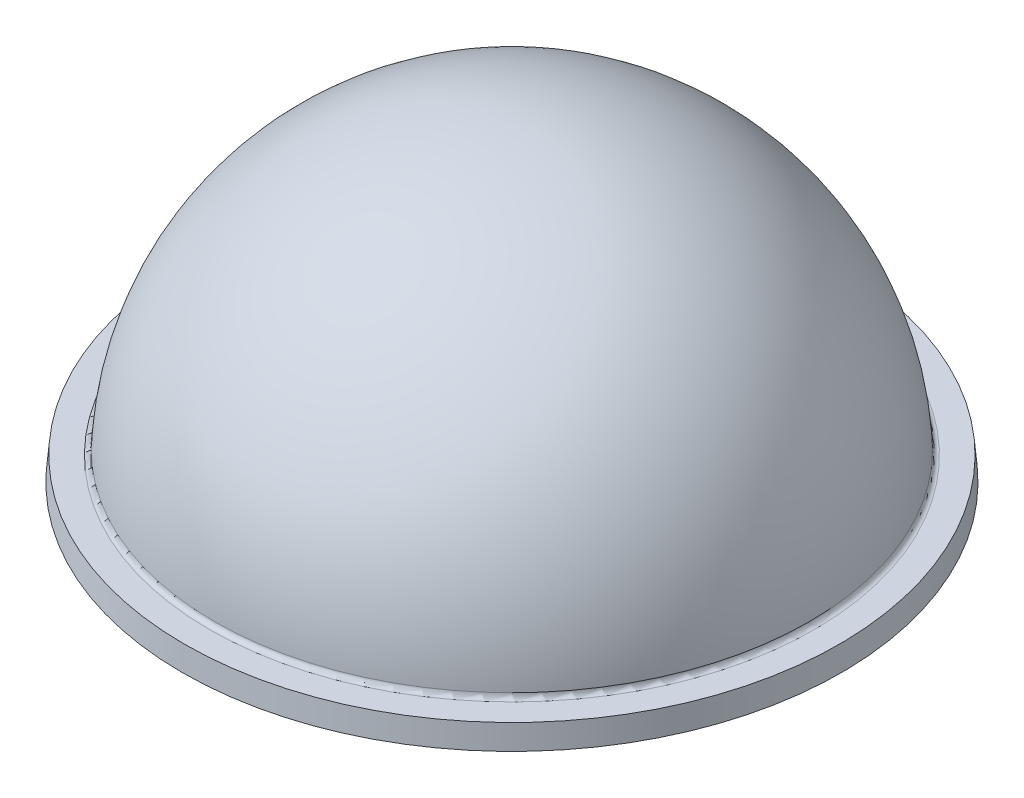
ISO-10303-21;
HEADER;
FILE_DESCRIPTION(('STEP AP214'),'2;1');
FILE_NAME('part.step','',(''),(''),'','','');
FILE_SCHEMA(('AUTOMOTIVE_DESIGN { 1 0 10303 214 1 1 1 1 }'));
ENDSEC;
DATA;
#1=APPLICATION_CONTEXT('core data for automotive mechanical design processes');
#2=APPLICATION_PROTOCOL_DEFINITION('international standard','automotive_design',2000,#1);
#3=PRODUCT_CONTEXT('',#1,'mechanical');
#4=PRODUCT('Part','Part','',(#3));
#5=PRODUCT_RELATED_PRODUCT_CATEGORY('part','',(#4));
#6=PRODUCT_DEFINITION_FORMATION('','',#4);
#7=PRODUCT_DEFINITION_CONTEXT('part definition',#1,'design');
#8=PRODUCT_DEFINITION('design','',#6,#7);
#9=PRODUCT_DEFINITION_SHAPE('','',#8);
#10=(LENGTH_UNIT() NAMED_UNIT(*) SI_UNIT(.MILLI.,.METRE.));
#11=(NAMED_UNIT(*) PLANE_ANGLE_UNIT() SI_UNIT($,.RADIAN.));
#12=(NAMED_UNIT(*) SI_UNIT($,.STERADIAN.) SOLID_ANGLE_UNIT());
#13=UNCERTAINTY_MEASURE_WITH_UNIT(LENGTH_MEASURE(1.E-05),#10,'distance_accuracy_value','');
#14=(GEOMETRIC_REPRESENTATION_CONTEXT(3) GLOBAL_UNCERTAINTY_ASSIGNED_CONTEXT((#13)) GLOBAL_UNIT_ASSIGNED_CONTEXT((#10,
#11,#12)) REPRESENTATION_CONTEXT('',''));
#15=CARTESIAN_POINT('',(0.,0.,0.));
#16=DIRECTION('',(0.,0.,1.));
#17=DIRECTION('',(1.,0.,0.));
#18=AXIS2_PLACEMENT_3D('',#15,#16,#17);
#19=CARTESIAN_POINT('',(0.,0.,0.));
#20=DIRECTION('',(0.,-1.,0.));
#21=DIRECTION('',(0.,0.,-1.));
#22=AXIS2_PLACEMENT_3D('',#19,#20,#21);
#23=CONICAL_SURFACE('',#22,52.3280824882222,0.0872664625997197);
#24=CARTESIAN_POINT('',(0.,3.75,0.));
#25=DIRECTION('',(0.,1.,0.));
#26=DIRECTION('',(0.,0.,1.));
#27=AXIS2_PLACEMENT_3D('',#24,#25,#26);
#28=CIRCLE('',#27,52.);
#29=CARTESIAN_POINT('',(0.,3.75,52.));
#30=VERTEX_POINT('',#29);
#31=EDGE_CURVE('E46',#30,#30,#28,.T.);
#32=ORIENTED_EDGE('',*,*,#31,.F.);
#33=EDGE_LOOP('',(#32));
#34=FACE_BOUND('',#33,.T.);
#35=CARTESIAN_POINT('',(0.,0.,0.));
#36=DIRECTION('',(0.,1.,0.));
#37=DIRECTION('',(0.,0.,1.));
#38=AXIS2_PLACEMENT_3D('',#35,#36,#37);
#39=CIRCLE('',#38,52.3280824882222);
#40=CARTESIAN_POINT('',(0.,0.,52.3280824882222));
#41=VERTEX_POINT('',#40);
#42=EDGE_CURVE('E10',#41,#41,#39,.T.);
#43=ORIENTED_EDGE('',*,*,#42,.T.);
#44=EDGE_LOOP('',(#43));
#45=FACE_BOUND('',#44,.T.);
#46=ADVANCED_FACE('F39',(#34,#45),#23,.T.);
#47=CARTESIAN_POINT('',(0.,3.75,-47.9983119703183));
#48=DIRECTION('',(0.,-1.,0.));
#49=DIRECTION('',(0.,0.,-1.));
#50=AXIS2_PLACEMENT_3D('',#47,#48,#49);
#51=PLANE('',#50);
#52=CARTESIAN_POINT('',(0.,3.75,0.));
#53=DIRECTION('',(0.,1.,0.));
#54=DIRECTION('',(0.,0.,1.));
#55=AXIS2_PLACEMENT_3D('',#52,#53,#54);
#56=CIRCLE('',#55,47.9983119703183);
#57=CARTESIAN_POINT('',(0.,3.75,47.9983119703183));
#58=VERTEX_POINT('',#57);
#59=EDGE_CURVE('E53',#58,#58,#56,.T.);
#60=ORIENTED_EDGE('',*,*,#59,.F.);
#61=EDGE_LOOP('',(#60));
#62=FACE_BOUND('',#61,.T.);
#63=ORIENTED_EDGE('',*,*,#31,.T.);
#64=EDGE_LOOP('',(#63));
#65=FACE_BOUND('',#64,.T.);
#66=ADVANCED_FACE('F90',(#62,#65),#51,.F.);
#67=CARTESIAN_POINT('',(0.,4.51200000000001,0.));
#68=DIRECTION('',(0.,1.,0.));
#69=DIRECTION('',(0.,0.,1.));
#70=AXIS2_PLACEMENT_3D('',#67,#68,#69);
#71=TOROIDAL_SURFACE('',#70,47.9983119703183,0.762000000000006);
#72=CARTESIAN_POINT('',(0.,4.47217509986684,0.));
#73=DIRECTION('',(0.,1.,0.));
#74=DIRECTION('',(0.,0.,1.));
#75=AXIS2_PLACEMENT_3D('',#72,#73,#74);
#76=CIRCLE('',#75,47.2373533792442);
#77=CARTESIAN_POINT('',(0.,4.47217509986684,47.2373533792442));
#78=VERTEX_POINT('',#77);
#79=EDGE_CURVE('E58',#78,#78,#76,.T.);
#80=ORIENTED_EDGE('',*,*,#79,.F.);
#81=EDGE_LOOP('',(#80));
#82=FACE_BOUND('',#81,.T.);
#83=ORIENTED_EDGE('',*,*,#59,.T.);
#84=EDGE_LOOP('',(#83));
#85=FACE_BOUND('',#84,.T.);
#86=ADVANCED_FACE('F86',(#82,#85),#71,.F.);
#87=CARTESIAN_POINT('',(0.,2.,0.));
#88=DIRECTION('',(0.,1.,0.));
#89=DIRECTION('',(0.,0.,-1.));
#90=AXIS2_PLACEMENT_3D('',#87,#88,#89);
#91=SPHERICAL_SURFACE('',#90,47.302);
#92=ORIENTED_EDGE('',*,*,#79,.T.);
#93=EDGE_LOOP('',(#92));
#94=FACE_BOUND('',#93,.T.);
#95=ADVANCED_FACE('F81',(#94),#91,.T.);
#96=CARTESIAN_POINT('',(0.,2.,0.));
#97=DIRECTION('',(0.,1.,0.));
#98=DIRECTION('',(0.,0.,1.));
#99=AXIS2_PLACEMENT_3D('',#96,#97,#98);
#100=SPHERICAL_SURFACE('',#99,43.552);
#101=CARTESIAN_POINT('',(0.,2.,0.));
#102=DIRECTION('',(0.,1.,0.));
#103=DIRECTION('',(0.,0.,1.));
#104=AXIS2_PLACEMENT_3D('',#101,#102,#103);
#105=CIRCLE('',#104,43.552);
#106=CARTESIAN_POINT('',(0.,2.,43.552));
#107=VERTEX_POINT('',#106);
#108=EDGE_CURVE('E63',#107,#107,#105,.T.);
#109=ORIENTED_EDGE('',*,*,#108,.F.);
#110=EDGE_LOOP('',(#109));
#111=FACE_BOUND('',#110,.T.);
#112=ADVANCED_FACE('F76',(#111),#100,.F.);
#113=CARTESIAN_POINT('',(0.,2.,0.));
#114=DIRECTION('',(0.,1.,0.));
#115=DIRECTION('',(0.,0.,1.));
#116=AXIS2_PLACEMENT_3D('',#113,#114,#115);
#117=TOROIDAL_SURFACE('',#116,45.552,2.);
#118=CARTESIAN_POINT('',(0.,0.,0.));
#119=DIRECTION('',(0.,1.,0.));
#120=DIRECTION('',(0.,0.,1.));
#121=AXIS2_PLACEMENT_3D('',#118,#119,#120);
#122=CIRCLE('',#121,45.552);
#123=CARTESIAN_POINT('',(0.,0.,45.552));
#124=VERTEX_POINT('',#123);
#125=EDGE_CURVE('E67',#124,#124,#122,.T.);
#126=ORIENTED_EDGE('',*,*,#125,.F.);
#127=EDGE_LOOP('',(#126));
#128=FACE_BOUND('',#127,.T.);
#129=ORIENTED_EDGE('',*,*,#108,.T.);
#130=EDGE_LOOP('',(#129));
#131=FACE_BOUND('',#130,.T.);
#132=ADVANCED_FACE('F73',(#128,#131),#117,.T.);
#133=CARTESIAN_POINT('',(0.,0.,-45.552));
#134=DIRECTION('',(0.,1.,0.));
#135=DIRECTION('',(0.,0.,1.));
#136=AXIS2_PLACEMENT_3D('',#133,#134,#135);
#137=PLANE('',#136);
#138=ORIENTED_EDGE('',*,*,#42,.F.);
#139=EDGE_LOOP('',(#138));
#140=FACE_BOUND('',#139,.T.);
#141=ORIENTED_EDGE('',*,*,#125,.T.);
#142=EDGE_LOOP('',(#141));
#143=FACE_BOUND('',#142,.T.);
#144=ADVANCED_FACE('F71',(#140,#143),#137,.F.);
#145=CLOSED_SHELL('',(#46,#66,#86,#95,#112,#132,#144));
#146=MANIFOLD_SOLID_BREP('B2',#145);
#147=ADVANCED_BREP_SHAPE_REPRESENTATION('',(#18,#146),#14);
#148=SHAPE_DEFINITION_REPRESENTATION(#9,#147);
ENDSEC;
END-ISO-10303-21;
